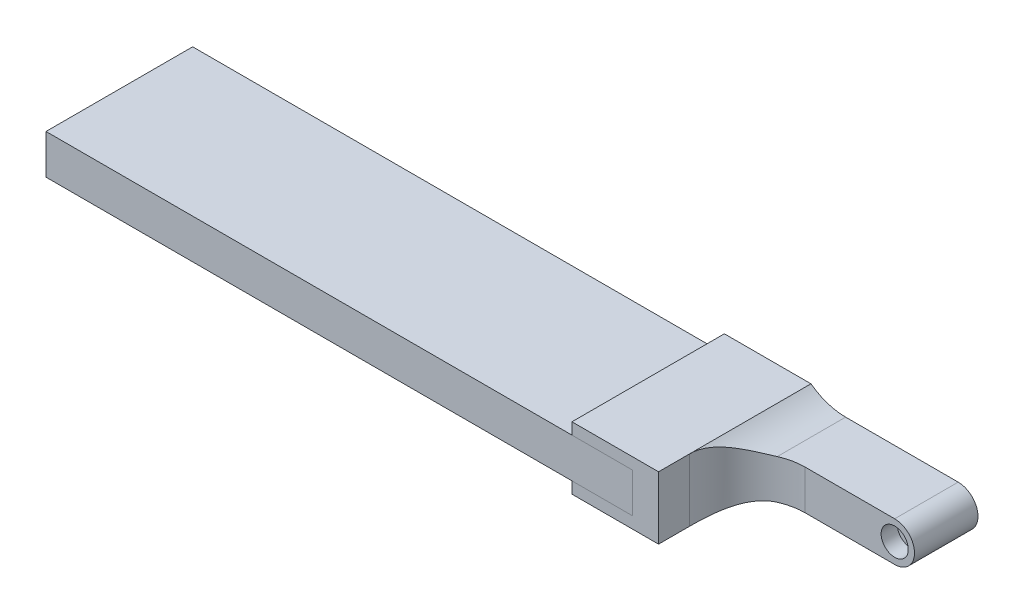
ISO-10303-21;
HEADER;
FILE_DESCRIPTION(('STEP AP214'),'2;1');
FILE_NAME('part.step','',(''),(''),'','','');
FILE_SCHEMA(('AUTOMOTIVE_DESIGN { 1 0 10303 214 1 1 1 1 }'));
ENDSEC;
DATA;
#1=APPLICATION_CONTEXT('core data for automotive mechanical design processes');
#2=APPLICATION_PROTOCOL_DEFINITION('international standard','automotive_design',2000,#1);
#3=PRODUCT_CONTEXT('',#1,'mechanical');
#4=PRODUCT('Part','Part','',(#3));
#5=PRODUCT_RELATED_PRODUCT_CATEGORY('part','',(#4));
#6=PRODUCT_DEFINITION_FORMATION('','',#4);
#7=PRODUCT_DEFINITION_CONTEXT('part definition',#1,'design');
#8=PRODUCT_DEFINITION('design','',#6,#7);
#9=PRODUCT_DEFINITION_SHAPE('','',#8);
#10=(LENGTH_UNIT() NAMED_UNIT(*) SI_UNIT(.MILLI.,.METRE.));
#11=(NAMED_UNIT(*) PLANE_ANGLE_UNIT() SI_UNIT($,.RADIAN.));
#12=(NAMED_UNIT(*) SI_UNIT($,.STERADIAN.) SOLID_ANGLE_UNIT());
#13=UNCERTAINTY_MEASURE_WITH_UNIT(LENGTH_MEASURE(1.E-05),#10,'distance_accuracy_value','');
#14=(GEOMETRIC_REPRESENTATION_CONTEXT(3) GLOBAL_UNCERTAINTY_ASSIGNED_CONTEXT((#13)) GLOBAL_UNIT_ASSIGNED_CONTEXT((#10,
#11,#12)) REPRESENTATION_CONTEXT('',''));
#15=CARTESIAN_POINT('',(0.,0.,0.));
#16=DIRECTION('',(0.,0.,1.));
#17=DIRECTION('',(1.,0.,0.));
#18=AXIS2_PLACEMENT_3D('',#15,#16,#17);
#19=CARTESIAN_POINT('',(-131.6,-3.42999999999993,0.));
#20=DIRECTION('',(0.,0.,1.));
#21=DIRECTION('',(1.,0.,0.));
#22=AXIS2_PLACEMENT_3D('',#19,#20,#21);
#23=PLANE('',#22);
#24=DIRECTION('',(0.,-1.,0.));
#25=VECTOR('',#24,1.);
#26=CARTESIAN_POINT('',(-30.,-3.42999999999998,0.));
#27=LINE('',#26,#25);
#28=CARTESIAN_POINT('',(-30.,3.43,0.));
#29=VERTEX_POINT('',#28);
#30=CARTESIAN_POINT('',(-30.,-3.42999999999998,0.));
#31=VERTEX_POINT('',#30);
#32=EDGE_CURVE('E116',#29,#31,#27,.T.);
#33=ORIENTED_EDGE('',*,*,#32,.T.);
#34=DIRECTION('',(1.,0.,0.));
#35=VECTOR('',#34,1.);
#36=CARTESIAN_POINT('',(-131.6,-3.42999999999993,0.));
#37=LINE('',#36,#35);
#38=CARTESIAN_POINT('',(-131.6,-3.42999999999993,0.));
#39=VERTEX_POINT('',#38);
#40=EDGE_CURVE('E12',#39,#31,#37,.T.);
#41=ORIENTED_EDGE('',*,*,#40,.F.);
#42=DIRECTION('',(0.,-1.,0.));
#43=VECTOR('',#42,1.);
#44=CARTESIAN_POINT('',(-131.6,-3.42999999999993,0.));
#45=LINE('',#44,#43);
#46=CARTESIAN_POINT('',(-131.6,3.43000000000005,0.));
#47=VERTEX_POINT('',#46);
#48=EDGE_CURVE('E104',#47,#39,#45,.T.);
#49=ORIENTED_EDGE('',*,*,#48,.F.);
#50=DIRECTION('',(1.,0.,0.));
#51=VECTOR('',#50,1.);
#52=CARTESIAN_POINT('',(-131.6,3.43000000000005,0.));
#53=LINE('',#52,#51);
#54=EDGE_CURVE('E112',#47,#29,#53,.T.);
#55=ORIENTED_EDGE('',*,*,#54,.T.);
#56=EDGE_LOOP('',(#33,#41,#49,#55));
#57=FACE_BOUND('',#56,.T.);
#58=ADVANCED_FACE('F53',(#57),#23,.F.);
#59=CARTESIAN_POINT('',(-131.6,-3.42999999999993,0.));
#60=DIRECTION('',(0.,1.,0.));
#61=DIRECTION('',(-1.,0.,0.));
#62=AXIS2_PLACEMENT_3D('',#59,#60,#61);
#63=PLANE('',#62);
#64=DIRECTION('',(0.,0.,1.));
#65=VECTOR('',#64,1.);
#66=CARTESIAN_POINT('',(-30.,-3.42999999999998,0.));
#67=LINE('',#66,#65);
#68=CARTESIAN_POINT('',(-30.,-3.42999999999998,25.4));
#69=VERTEX_POINT('',#68);
#70=EDGE_CURVE('E108',#31,#69,#67,.T.);
#71=ORIENTED_EDGE('',*,*,#70,.T.);
#72=DIRECTION('',(1.,0.,0.));
#73=VECTOR('',#72,1.);
#74=CARTESIAN_POINT('',(-131.6,-3.42999999999993,25.4));
#75=LINE('',#74,#73);
#76=CARTESIAN_POINT('',(-131.6,-3.42999999999993,25.4));
#77=VERTEX_POINT('',#76);
#78=EDGE_CURVE('E61',#77,#69,#75,.T.);
#79=ORIENTED_EDGE('',*,*,#78,.F.);
#80=DIRECTION('',(0.,0.,1.));
#81=VECTOR('',#80,1.);
#82=CARTESIAN_POINT('',(-131.6,-3.42999999999993,0.));
#83=LINE('',#82,#81);
#84=EDGE_CURVE('E99',#39,#77,#83,.T.);
#85=ORIENTED_EDGE('',*,*,#84,.F.);
#86=ORIENTED_EDGE('',*,*,#40,.T.);
#87=EDGE_LOOP('',(#71,#79,#85,#86));
#88=FACE_BOUND('',#87,.T.);
#89=ADVANCED_FACE('F107',(#88),#63,.F.);
#90=CARTESIAN_POINT('',(-131.6,-3.42999999999993,25.4));
#91=DIRECTION('',(0.,0.,-1.));
#92=DIRECTION('',(-1.,0.,0.));
#93=AXIS2_PLACEMENT_3D('',#90,#91,#92);
#94=PLANE('',#93);
#95=DIRECTION('',(0.,1.,0.));
#96=VECTOR('',#95,1.);
#97=CARTESIAN_POINT('',(-30.,-3.42999999999998,25.4));
#98=LINE('',#97,#96);
#99=CARTESIAN_POINT('',(-30.,3.43,25.4));
#100=VERTEX_POINT('',#99);
#101=EDGE_CURVE('E86',#69,#100,#98,.T.);
#102=ORIENTED_EDGE('',*,*,#101,.T.);
#103=DIRECTION('',(1.,0.,0.));
#104=VECTOR('',#103,1.);
#105=CARTESIAN_POINT('',(-131.6,3.43000000000005,25.4));
#106=LINE('',#105,#104);
#107=CARTESIAN_POINT('',(-131.6,3.43000000000005,25.4));
#108=VERTEX_POINT('',#107);
#109=EDGE_CURVE('E109',#108,#100,#106,.T.);
#110=ORIENTED_EDGE('',*,*,#109,.F.);
#111=DIRECTION('',(0.,1.,0.));
#112=VECTOR('',#111,1.);
#113=CARTESIAN_POINT('',(-131.6,-3.42999999999993,25.4));
#114=LINE('',#113,#112);
#115=EDGE_CURVE('E102',#77,#108,#114,.T.);
#116=ORIENTED_EDGE('',*,*,#115,.F.);
#117=ORIENTED_EDGE('',*,*,#78,.T.);
#118=EDGE_LOOP('',(#102,#110,#116,#117));
#119=FACE_BOUND('',#118,.T.);
#120=ADVANCED_FACE('F110',(#119),#94,.F.);
#121=CARTESIAN_POINT('',(-131.6,3.43000000000005,0.));
#122=DIRECTION('',(0.,-1.,0.));
#123=DIRECTION('',(1.,0.,0.));
#124=AXIS2_PLACEMENT_3D('',#121,#122,#123);
#125=PLANE('',#124);
#126=DIRECTION('',(0.,0.,-1.));
#127=VECTOR('',#126,1.);
#128=CARTESIAN_POINT('',(-30.,3.43,0.));
#129=LINE('',#128,#127);
#130=EDGE_CURVE('E92',#100,#29,#129,.T.);
#131=ORIENTED_EDGE('',*,*,#130,.T.);
#132=ORIENTED_EDGE('',*,*,#54,.F.);
#133=DIRECTION('',(0.,0.,-1.));
#134=VECTOR('',#133,1.);
#135=CARTESIAN_POINT('',(-131.6,3.43000000000005,0.));
#136=LINE('',#135,#134);
#137=EDGE_CURVE('E69',#108,#47,#136,.T.);
#138=ORIENTED_EDGE('',*,*,#137,.F.);
#139=ORIENTED_EDGE('',*,*,#109,.T.);
#140=EDGE_LOOP('',(#131,#132,#138,#139));
#141=FACE_BOUND('',#140,.T.);
#142=ADVANCED_FACE('F123',(#141),#125,.F.);
#143=CARTESIAN_POINT('',(-131.6,0.,0.));
#144=DIRECTION('',(1.,0.,0.));
#145=DIRECTION('',(0.,1.,0.));
#146=AXIS2_PLACEMENT_3D('',#143,#144,#145);
#147=PLANE('',#146);
#148=ORIENTED_EDGE('',*,*,#48,.T.);
#149=ORIENTED_EDGE('',*,*,#84,.T.);
#150=ORIENTED_EDGE('',*,*,#115,.T.);
#151=ORIENTED_EDGE('',*,*,#137,.T.);
#152=EDGE_LOOP('',(#148,#149,#150,#151));
#153=FACE_BOUND('',#152,.T.);
#154=ADVANCED_FACE('F100',(#153),#147,.F.);
#155=CARTESIAN_POINT('',(-30.,0.,0.));
#156=DIRECTION('',(1.,0.,0.));
#157=DIRECTION('',(0.,1.,0.));
#158=AXIS2_PLACEMENT_3D('',#155,#156,#157);
#159=PLANE('',#158);
#160=ORIENTED_EDGE('',*,*,#32,.F.);
#161=ORIENTED_EDGE('',*,*,#130,.F.);
#162=ORIENTED_EDGE('',*,*,#101,.F.);
#163=ORIENTED_EDGE('',*,*,#70,.F.);
#164=EDGE_LOOP('',(#160,#161,#162,#163));
#165=FACE_BOUND('',#164,.T.);
#166=ADVANCED_FACE('F126',(#165),#159,.T.);
#167=CLOSED_SHELL('',(#58,#89,#120,#142,#154,#166));
#168=MANIFOLD_SOLID_BREP('B2',#167);
#169=CARTESIAN_POINT('',(0.,3.43,10.));
#170=DIRECTION('',(0.,-1.,0.));
#171=DIRECTION('',(0.,0.,-1.));
#172=AXIS2_PLACEMENT_3D('',#169,#170,#171);
#173=PLANE('',#172);
#174=DIRECTION('',(0.,0.,-1.));
#175=VECTOR('',#174,1.);
#176=CARTESIAN_POINT('',(0.,3.43,10.));
#177=LINE('',#176,#175);
#178=CARTESIAN_POINT('',(0.,3.43,10.));
#179=VERTEX_POINT('',#178);
#180=CARTESIAN_POINT('',(0.,3.43,-1.));
#181=VERTEX_POINT('',#180);
#182=EDGE_CURVE('E294',#179,#181,#177,.T.);
#183=ORIENTED_EDGE('',*,*,#182,.T.);
#184=DIRECTION('',(1.,0.,0.));
#185=VECTOR('',#184,1.);
#186=CARTESIAN_POINT('',(-19.5,3.43,-1.));
#187=LINE('',#186,#185);
#188=CARTESIAN_POINT('',(-19.5,3.43,-1.));
#189=VERTEX_POINT('',#188);
#190=EDGE_CURVE('E309',#189,#181,#187,.T.);
#191=ORIENTED_EDGE('',*,*,#190,.F.);
#192=DIRECTION('',(0.,0.,-1.));
#193=VECTOR('',#192,1.);
#194=CARTESIAN_POINT('',(-19.5,3.43,10.));
#195=LINE('',#194,#193);
#196=CARTESIAN_POINT('',(-19.5,3.43,10.8348486100883));
#197=VERTEX_POINT('',#196);
#198=EDGE_CURVE('E204',#189,#197,#195,.F.);
#199=ORIENTED_EDGE('',*,*,#198,.T.);
#200=CARTESIAN_POINT('',(-15.5,3.43,20.));
#201=DIRECTION('',(0.,-1.,0.));
#202=DIRECTION('',(0.,0.,-1.));
#203=AXIS2_PLACEMENT_3D('',#200,#201,#202);
#204=CIRCLE('',#203,10.);
#205=CARTESIAN_POINT('',(-15.5,3.43,10.));
#206=VERTEX_POINT('',#205);
#207=EDGE_CURVE('E395',#197,#206,#204,.T.);
#208=ORIENTED_EDGE('',*,*,#207,.T.);
#209=DIRECTION('',(-1.,0.,0.));
#210=VECTOR('',#209,1.);
#211=CARTESIAN_POINT('',(0.,3.43,10.));
#212=LINE('',#211,#210);
#213=EDGE_CURVE('E372',#179,#206,#212,.T.);
#214=ORIENTED_EDGE('',*,*,#213,.F.);
#215=EDGE_LOOP('',(#183,#191,#199,#208,#214));
#216=FACE_BOUND('',#215,.T.);
#217=ADVANCED_FACE('F177',(#216),#173,.F.);
#218=CARTESIAN_POINT('',(0.,0.,10.));
#219=DIRECTION('',(0.,0.,-1.));
#220=DIRECTION('',(-1.,0.,0.));
#221=AXIS2_PLACEMENT_3D('',#218,#219,#220);
#222=CYLINDRICAL_SURFACE('',#221,3.43);
#223=CARTESIAN_POINT('',(0.,0.,10.));
#224=DIRECTION('',(0.,0.,1.));
#225=DIRECTION('',(1.,0.,0.));
#226=AXIS2_PLACEMENT_3D('',#223,#224,#225);
#227=CIRCLE('',#226,3.43);
#228=CARTESIAN_POINT('',(0.,-3.43,10.));
#229=VERTEX_POINT('',#228);
#230=EDGE_CURVE('E289',#229,#179,#227,.T.);
#231=ORIENTED_EDGE('',*,*,#230,.F.);
#232=DIRECTION('',(0.,0.,-1.));
#233=VECTOR('',#232,1.);
#234=CARTESIAN_POINT('',(0.,-3.43,10.));
#235=LINE('',#234,#233);
#236=CARTESIAN_POINT('',(0.,-3.43,-1.));
#237=VERTEX_POINT('',#236);
#238=EDGE_CURVE('E283',#229,#237,#235,.T.);
#239=ORIENTED_EDGE('',*,*,#238,.T.);
#240=CARTESIAN_POINT('',(0.,0.,-1.));
#241=DIRECTION('',(0.,0.,-1.));
#242=DIRECTION('',(-1.,0.,0.));
#243=AXIS2_PLACEMENT_3D('',#240,#241,#242);
#244=CIRCLE('',#243,3.43);
#245=EDGE_CURVE('E287',#181,#237,#244,.T.);
#246=ORIENTED_EDGE('',*,*,#245,.F.);
#247=ORIENTED_EDGE('',*,*,#182,.F.);
#248=EDGE_LOOP('',(#231,#239,#246,#247));
#249=FACE_BOUND('',#248,.T.);
#250=ADVANCED_FACE('F285',(#249),#222,.T.);
#251=CARTESIAN_POINT('',(0.,0.,10.));
#252=DIRECTION('',(0.,0.,1.));
#253=DIRECTION('',(1.,0.,0.));
#254=AXIS2_PLACEMENT_3D('',#251,#252,#253);
#255=PLANE('',#254);
#256=ORIENTED_EDGE('',*,*,#213,.T.);
#257=DIRECTION('',(0.,1.,0.));
#258=VECTOR('',#257,1.);
#259=CARTESIAN_POINT('',(-15.5,0.,10.));
#260=LINE('',#259,#258);
#261=CARTESIAN_POINT('',(-15.5,-3.42999999999999,10.));
#262=VERTEX_POINT('',#261);
#263=EDGE_CURVE('E393',#206,#262,#260,.F.);
#264=ORIENTED_EDGE('',*,*,#263,.T.);
#265=DIRECTION('',(-1.,0.,0.));
#266=VECTOR('',#265,1.);
#267=CARTESIAN_POINT('',(0.,-3.43,10.));
#268=LINE('',#267,#266);
#269=EDGE_CURVE('E375',#229,#262,#268,.T.);
#270=ORIENTED_EDGE('',*,*,#269,.F.);
#271=ORIENTED_EDGE('',*,*,#230,.T.);
#272=EDGE_LOOP('',(#256,#264,#270,#271));
#273=FACE_BOUND('',#272,.T.);
#274=CARTESIAN_POINT('',(0.,0.,10.));
#275=DIRECTION('',(0.,0.,1.));
#276=DIRECTION('',(1.,0.,0.));
#277=AXIS2_PLACEMENT_3D('',#274,#275,#276);
#278=CIRCLE('',#277,2.35);
#279=CARTESIAN_POINT('',(2.35,0.,10.));
#280=VERTEX_POINT('',#279);
#281=EDGE_CURVE('E380',#280,#280,#278,.T.);
#282=ORIENTED_EDGE('',*,*,#281,.F.);
#283=EDGE_LOOP('',(#282));
#284=FACE_BOUND('',#283,.T.);
#285=ADVANCED_FACE('F428',(#273,#284),#255,.T.);
#286=CARTESIAN_POINT('',(0.,0.,7.2));
#287=DIRECTION('',(0.,0.,1.));
#288=DIRECTION('',(1.,0.,0.));
#289=AXIS2_PLACEMENT_3D('',#286,#287,#288);
#290=CYLINDRICAL_SURFACE('',#289,2.35);
#291=CARTESIAN_POINT('',(0.,0.,7.2));
#292=DIRECTION('',(0.,0.,1.));
#293=DIRECTION('',(1.,0.,0.));
#294=AXIS2_PLACEMENT_3D('',#291,#292,#293);
#295=CIRCLE('',#294,2.35);
#296=CARTESIAN_POINT('',(2.35,0.,7.2));
#297=VERTEX_POINT('',#296);
#298=EDGE_CURVE('E385',#297,#297,#295,.T.);
#299=ORIENTED_EDGE('',*,*,#298,.F.);
#300=EDGE_LOOP('',(#299));
#301=FACE_BOUND('',#300,.T.);
#302=ORIENTED_EDGE('',*,*,#281,.T.);
#303=EDGE_LOOP('',(#302));
#304=FACE_BOUND('',#303,.T.);
#305=ADVANCED_FACE('F439',(#301,#304),#290,.F.);
#306=CARTESIAN_POINT('',(0.,0.,7.2));
#307=DIRECTION('',(0.,0.,1.));
#308=DIRECTION('',(1.,0.,0.));
#309=AXIS2_PLACEMENT_3D('',#306,#307,#308);
#310=PLANE('',#309);
#311=ORIENTED_EDGE('',*,*,#298,.T.);
#312=EDGE_LOOP('',(#311));
#313=FACE_BOUND('',#312,.T.);
#314=ADVANCED_FACE('F435',(#313),#310,.T.);
#315=CARTESIAN_POINT('',(-30.,0.,10.));
#316=DIRECTION('',(1.,0.,0.));
#317=DIRECTION('',(0.,1.,0.));
#318=AXIS2_PLACEMENT_3D('',#315,#316,#317);
#319=PLANE('',#318);
#320=DIRECTION('',(0.,-1.,0.));
#321=VECTOR('',#320,1.);
#322=CARTESIAN_POINT('',(-30.,0.,0.));
#323=LINE('',#322,#321);
#324=CARTESIAN_POINT('',(-30.,3.43,0.));
#325=VERTEX_POINT('',#324);
#326=CARTESIAN_POINT('',(-30.,-3.42999999999998,0.));
#327=VERTEX_POINT('',#326);
#328=EDGE_CURVE('E371',#325,#327,#323,.T.);
#329=ORIENTED_EDGE('',*,*,#328,.T.);
#330=DIRECTION('',(0.,0.,-1.));
#331=VECTOR('',#330,1.);
#332=CARTESIAN_POINT('',(-30.,-3.42999999999998,10.));
#333=LINE('',#332,#331);
#334=CARTESIAN_POINT('',(-30.,-3.42999999999998,25.4));
#335=VERTEX_POINT('',#334);
#336=EDGE_CURVE('E293',#335,#327,#333,.T.);
#337=ORIENTED_EDGE('',*,*,#336,.F.);
#338=DIRECTION('',(0.,-1.,0.));
#339=VECTOR('',#338,1.);
#340=CARTESIAN_POINT('',(-30.,-3.42999999999998,25.4));
#341=LINE('',#340,#339);
#342=CARTESIAN_POINT('',(-30.,3.43,25.4));
#343=VERTEX_POINT('',#342);
#344=EDGE_CURVE('E366',#343,#335,#341,.T.);
#345=ORIENTED_EDGE('',*,*,#344,.F.);
#346=DIRECTION('',(0.,0.,-1.));
#347=VECTOR('',#346,1.);
#348=CARTESIAN_POINT('',(-30.,3.43,10.));
#349=LINE('',#348,#347);
#350=EDGE_CURVE('E377',#343,#325,#349,.T.);
#351=ORIENTED_EDGE('',*,*,#350,.T.);
#352=EDGE_LOOP('',(#329,#337,#345,#351));
#353=FACE_BOUND('',#352,.T.);
#354=ADVANCED_FACE('F432',(#353),#319,.F.);
#355=CARTESIAN_POINT('',(0.,-3.43,10.));
#356=DIRECTION('',(0.,-1.,0.));
#357=DIRECTION('',(1.,0.,0.));
#358=AXIS2_PLACEMENT_3D('',#355,#356,#357);
#359=PLANE('',#358);
#360=CARTESIAN_POINT('',(-15.5,-3.42999999999999,20.));
#361=DIRECTION('',(0.,-1.,0.));
#362=DIRECTION('',(1.,0.,0.));
#363=AXIS2_PLACEMENT_3D('',#360,#361,#362);
#364=CIRCLE('',#363,10.);
#365=CARTESIAN_POINT('',(-19.5,-3.42999999999999,10.8348486100883));
#366=VERTEX_POINT('',#365);
#367=EDGE_CURVE('E397',#262,#366,#364,.F.);
#368=ORIENTED_EDGE('',*,*,#367,.T.);
#369=DIRECTION('',(0.,0.,-1.));
#370=VECTOR('',#369,1.);
#371=CARTESIAN_POINT('',(-19.5,-3.42999999999999,0.));
#372=LINE('',#371,#370);
#373=CARTESIAN_POINT('',(-19.5,-3.42999999999999,-1.));
#374=VERTEX_POINT('',#373);
#375=EDGE_CURVE('E300',#366,#374,#372,.T.);
#376=ORIENTED_EDGE('',*,*,#375,.T.);
#377=DIRECTION('',(-1.,0.,0.));
#378=VECTOR('',#377,1.);
#379=CARTESIAN_POINT('',(0.,-3.43,-1.));
#380=LINE('',#379,#378);
#381=EDGE_CURVE('E297',#237,#374,#380,.T.);
#382=ORIENTED_EDGE('',*,*,#381,.F.);
#383=ORIENTED_EDGE('',*,*,#238,.F.);
#384=ORIENTED_EDGE('',*,*,#269,.T.);
#385=EDGE_LOOP('',(#368,#376,#382,#383,#384));
#386=FACE_BOUND('',#385,.T.);
#387=ADVANCED_FACE('F298',(#386),#359,.T.);
#388=CARTESIAN_POINT('',(-25.5,-3.42999999999998,25.4));
#389=DIRECTION('',(-1.,0.,0.));
#390=DIRECTION('',(0.,0.,1.));
#391=AXIS2_PLACEMENT_3D('',#388,#389,#390);
#392=PLANE('',#391);
#393=DIRECTION('',(0.,1.,0.));
#394=VECTOR('',#393,1.);
#395=CARTESIAN_POINT('',(-25.5,-3.42999999999998,20.));
#396=LINE('',#395,#394);
#397=CARTESIAN_POINT('',(-25.5,-5.42999999999998,20.));
#398=VERTEX_POINT('',#397);
#399=CARTESIAN_POINT('',(-25.5,5.43,20.));
#400=VERTEX_POINT('',#399);
#401=EDGE_CURVE('E391',#398,#400,#396,.T.);
#402=ORIENTED_EDGE('',*,*,#401,.T.);
#403=DIRECTION('',(0.,0.,-1.));
#404=VECTOR('',#403,1.);
#405=CARTESIAN_POINT('',(-25.5,5.43,25.4));
#406=LINE('',#405,#404);
#407=CARTESIAN_POINT('',(-25.5,5.43,25.4));
#408=VERTEX_POINT('',#407);
#409=EDGE_CURVE('E348',#408,#400,#406,.T.);
#410=ORIENTED_EDGE('',*,*,#409,.F.);
#411=DIRECTION('',(0.,1.,0.));
#412=VECTOR('',#411,1.);
#413=CARTESIAN_POINT('',(-25.5,-3.42999999999998,25.4));
#414=LINE('',#413,#412);
#415=CARTESIAN_POINT('',(-25.5,-5.42999999999998,25.4));
#416=VERTEX_POINT('',#415);
#417=EDGE_CURVE('E369',#416,#408,#414,.T.);
#418=ORIENTED_EDGE('',*,*,#417,.F.);
#419=DIRECTION('',(0.,0.,-1.));
#420=VECTOR('',#419,1.);
#421=CARTESIAN_POINT('',(-25.5,-5.42999999999998,25.4));
#422=LINE('',#421,#420);
#423=EDGE_CURVE('E329',#416,#398,#422,.T.);
#424=ORIENTED_EDGE('',*,*,#423,.T.);
#425=EDGE_LOOP('',(#402,#410,#418,#424));
#426=FACE_BOUND('',#425,.T.);
#427=ADVANCED_FACE('F471',(#426),#392,.F.);
#428=CARTESIAN_POINT('',(0.,0.,25.4));
#429=DIRECTION('',(0.,0.,-1.));
#430=DIRECTION('',(-1.,0.,0.));
#431=AXIS2_PLACEMENT_3D('',#428,#429,#430);
#432=PLANE('',#431);
#433=ORIENTED_EDGE('',*,*,#344,.T.);
#434=DIRECTION('',(1.,0.,0.));
#435=VECTOR('',#434,1.);
#436=CARTESIAN_POINT('',(-25.5,-3.42999999999998,25.4));
#437=LINE('',#436,#435);
#438=CARTESIAN_POINT('',(-40.5,-3.42999999999998,25.4));
#439=VERTEX_POINT('',#438);
#440=EDGE_CURVE('E327',#439,#335,#437,.T.);
#441=ORIENTED_EDGE('',*,*,#440,.F.);
#442=DIRECTION('',(0.,1.,0.));
#443=VECTOR('',#442,1.);
#444=CARTESIAN_POINT('',(-40.5,-5.42999999999997,25.4));
#445=LINE('',#444,#443);
#446=CARTESIAN_POINT('',(-40.5,-5.42999999999997,25.4));
#447=VERTEX_POINT('',#446);
#448=EDGE_CURVE('E339',#447,#439,#445,.T.);
#449=ORIENTED_EDGE('',*,*,#448,.F.);
#450=DIRECTION('',(1.,0.,0.));
#451=VECTOR('',#450,1.);
#452=CARTESIAN_POINT('',(-25.5,-5.42999999999998,25.4));
#453=LINE('',#452,#451);
#454=EDGE_CURVE('E332',#447,#416,#453,.T.);
#455=ORIENTED_EDGE('',*,*,#454,.T.);
#456=ORIENTED_EDGE('',*,*,#417,.T.);
#457=DIRECTION('',(1.,0.,0.));
#458=VECTOR('',#457,1.);
#459=CARTESIAN_POINT('',(-25.5,5.43,25.4));
#460=LINE('',#459,#458);
#461=CARTESIAN_POINT('',(-40.5,5.43,25.4));
#462=VERTEX_POINT('',#461);
#463=EDGE_CURVE('E354',#462,#408,#460,.T.);
#464=ORIENTED_EDGE('',*,*,#463,.F.);
#465=DIRECTION('',(0.,-1.,0.));
#466=VECTOR('',#465,1.);
#467=CARTESIAN_POINT('',(-40.5,5.43,25.4));
#468=LINE('',#467,#466);
#469=CARTESIAN_POINT('',(-40.5,3.43,25.4));
#470=VERTEX_POINT('',#469);
#471=EDGE_CURVE('E357',#462,#470,#468,.T.);
#472=ORIENTED_EDGE('',*,*,#471,.T.);
#473=DIRECTION('',(1.,0.,0.));
#474=VECTOR('',#473,1.);
#475=CARTESIAN_POINT('',(-25.5,3.43,25.4));
#476=LINE('',#475,#474);
#477=EDGE_CURVE('E362',#470,#343,#476,.T.);
#478=ORIENTED_EDGE('',*,*,#477,.T.);
#479=EDGE_LOOP('',(#433,#441,#449,#455,#456,#464,#472,#478));
#480=FACE_BOUND('',#479,.T.);
#481=ADVANCED_FACE('F473',(#480),#432,.F.);
#482=CARTESIAN_POINT('',(-15.5,-3.42999999999998,20.));
#483=DIRECTION('',(0.,1.,0.));
#484=DIRECTION('',(0.,0.,1.));
#485=AXIS2_PLACEMENT_3D('',#482,#483,#484);
#486=CYLINDRICAL_SURFACE('',#485,10.);
#487=ORIENTED_EDGE('',*,*,#367,.F.);
#488=ORIENTED_EDGE('',*,*,#263,.F.);
#489=ORIENTED_EDGE('',*,*,#207,.F.);
#490=CARTESIAN_POINT('',(-19.5,3.43,10.8348486100883));
#491=CARTESIAN_POINT('',(-19.6187109610031,3.42999837212061,10.8866561290224));
#492=CARTESIAN_POINT('',(-19.7363889836066,3.43211421942015,10.9407635059395));
#493=CARTESIAN_POINT('',(-19.9694243170225,3.44034397106759,11.0534370178745));
#494=CARTESIAN_POINT('',(-20.0847820291021,3.4464571778896,11.112002373415));
#495=CARTESIAN_POINT('',(-20.4266852270623,3.47041293678749,11.2940059682856));
#496=CARTESIAN_POINT('',(-20.6494461428949,3.49387317096378,11.4239201349009));
#497=CARTESIAN_POINT('',(-21.0810890071107,3.55339908248872,11.6984135701289));
#498=CARTESIAN_POINT('',(-21.2900755967413,3.58935233273701,11.8428541387368));
#499=CARTESIAN_POINT('',(-21.6952191181028,3.67173376738858,12.1461274486718));
#500=CARTESIAN_POINT('',(-21.8913717192728,3.71816546425045,12.3049650052761));
#501=CARTESIAN_POINT('',(-22.2689111737217,3.81901171815238,12.6349235724211));
#502=CARTESIAN_POINT('',(-22.4503719824313,3.87338185391026,12.8059736867876));
#503=CARTESIAN_POINT('',(-22.7990598738679,3.98807605812059,13.1600072251384));
#504=CARTESIAN_POINT('',(-22.9662881821942,4.0483996129399,13.3429896192001));
#505=CARTESIAN_POINT('',(-23.4472234908114,4.23555505306645,13.9100325216959));
#506=CARTESIAN_POINT('',(-23.73904519219,4.36824419143136,14.3111912646023));
#507=CARTESIAN_POINT('',(-24.1478131208893,4.57418335256193,14.9706305466454));
#508=CARTESIAN_POINT('',(-24.2858995400851,4.64838737679132,15.2159136270562));
#509=CARTESIAN_POINT('',(-24.5414182127357,4.79254761445333,15.7183960125155));
#510=CARTESIAN_POINT('',(-24.6588465170332,4.8625030140176,15.9755975841432));
#511=CARTESIAN_POINT('',(-24.8716865514968,4.99432453719016,16.4998197027327));
#512=CARTESIAN_POINT('',(-24.9671760604903,5.05621889027129,16.7668015454309));
#513=CARTESIAN_POINT('',(-25.1356123157912,5.16863487496453,17.3100678339152));
#514=CARTESIAN_POINT('',(-25.2085703994759,5.21916222274678,17.5863475233372));
#515=CARTESIAN_POINT('',(-25.3075953191934,5.28911737288216,18.0397388392999));
#516=CARTESIAN_POINT('',(-25.3409424899082,5.31306413138,18.2145982995132));
#517=CARTESIAN_POINT('',(-25.3983327587577,5.3546717695703,18.5665490065889));
#518=CARTESIAN_POINT('',(-25.4223784212995,5.37233438168127,18.7436396244031));
#519=CARTESIAN_POINT('',(-25.4610501627541,5.40089697506265,19.1001442162141));
#520=CARTESIAN_POINT('',(-25.4756365458399,5.41176845043991,19.2795647990223));
#521=CARTESIAN_POINT('',(-25.4951217241856,5.4263419510398,19.6393180845468));
#522=CARTESIAN_POINT('',(-25.5000151879644,5.43004003059368,19.819651234573));
#523=CARTESIAN_POINT('',(-25.5,5.43,20.));
#524=B_SPLINE_CURVE_WITH_KNOTS('',3,(#490,#491,#492,#493,#494,#495,#496,#497,#498,#499,#500,
#501,#502,#503,#504,#505,#506,#507,#508,#509,#510,#511,#512,#513,#514,#515,#516,#517,#518,#519,
#520,#521,#522,#523),.UNSPECIFIED.,.F.,.F.,(4,2,2,2,2,2,2,2,2,2,2,2,2,2,2,2,4),(0.,
0.388479442585753,0.77689111488955,1.55245826320373,2.32121934007227,3.09023849554652,
3.85510858334244,4.61991273931814,6.15411710124245,7.02663873389677,7.89932698338389,
8.76887186381761,9.63797849050516,10.1765014044168,10.7148757426563,11.2554949919626,
11.7964115203166),.UNSPECIFIED.);
#525=EDGE_CURVE('E191',#197,#400,#524,.T.);
#526=ORIENTED_EDGE('',*,*,#525,.T.);
#527=ORIENTED_EDGE('',*,*,#401,.F.);
#528=CARTESIAN_POINT('',(-25.5,-5.42999999999998,20.));
#529=CARTESIAN_POINT('',(-25.5000017185279,-5.43000727064081,19.8705078019825));
#530=CARTESIAN_POINT('',(-25.4974841361309,-5.42811242665482,19.7410366557674));
#531=CARTESIAN_POINT('',(-25.4874343158094,-5.4205875101876,19.4824104033922));
#532=CARTESIAN_POINT('',(-25.4799025760992,-5.41495780880759,19.3532552671124));
#533=CARTESIAN_POINT('',(-25.4498518691412,-5.39259209100616,18.9670292246558));
#534=CARTESIAN_POINT('',(-25.4198772515411,-5.37037904629476,18.7108010943432));
#535=CARTESIAN_POINT('',(-25.340926177625,-5.31298646133182,18.2052643459503));
#536=CARTESIAN_POINT('',(-25.2921251768277,-5.2779267943594,17.9559139720309));
#537=CARTESIAN_POINT('',(-25.1762155923526,-5.19680055007461,17.4632883131055));
#538=CARTESIAN_POINT('',(-25.1091017499632,-5.15073081158501,17.2200147950649));
#539=CARTESIAN_POINT('',(-24.9577101442283,-5.05016732443746,16.7420479968007));
#540=CARTESIAN_POINT('',(-24.8735184253046,-4.99571612381725,16.5073183998347));
#541=CARTESIAN_POINT('',(-24.6885252055983,-4.88066723090059,16.0461699174762));
#542=CARTESIAN_POINT('',(-24.5877245640328,-4.82006985662194,15.8197506029145));
#543=CARTESIAN_POINT('',(-24.2604373097866,-4.63218753376791,15.1522429308597));
#544=CARTESIAN_POINT('',(-24.0095275578826,-4.49914380807644,14.724351600942));
#545=CARTESIAN_POINT('',(-23.5686938663888,-4.29343003284353,14.0860086416206));
#546=CARTESIAN_POINT('',(-23.3992075068257,-4.2194928825914,13.8614364983551));
#547=CARTESIAN_POINT('',(-23.0410560690294,-4.07595816223974,13.4264330475396));
#548=CARTESIAN_POINT('',(-22.8523875871359,-4.0063613658362,13.2160042606172));
#549=CARTESIAN_POINT('',(-22.4572908892903,-3.8750201939718,12.8114117734756));
#550=CARTESIAN_POINT('',(-22.2509277895735,-3.81324893840748,12.6171932228206));
#551=CARTESIAN_POINT('',(-21.8207568593062,-3.70048488769441,12.2457310847799));
#552=CARTESIAN_POINT('',(-21.5969568926783,-3.64948727177418,12.0684799246675));
#553=CARTESIAN_POINT('',(-21.2211804180264,-3.57814632647348,11.7963603999534));
#554=CARTESIAN_POINT('',(-21.0741446748089,-3.55351159926268,11.6957374635946));
#555=CARTESIAN_POINT('',(-20.7742980112029,-3.51036821847339,11.5021409055842));
#556=CARTESIAN_POINT('',(-20.6214890216462,-3.49185753659807,11.4091647589811));
#557=CARTESIAN_POINT('',(-20.3099739112437,-3.46162465746269,11.2309376515154));
#558=CARTESIAN_POINT('',(-20.1512472128096,-3.44992907402127,11.1457180589939));
#559=CARTESIAN_POINT('',(-19.8290162038564,-3.43410827738094,10.9837791753611));
#560=CARTESIAN_POINT('',(-19.6655086642838,-3.42998830673867,10.9070658052902));
#561=CARTESIAN_POINT('',(-19.5,-3.42999999999999,10.8348486100883));
#562=B_SPLINE_CURVE_WITH_KNOTS('',3,(#528,#529,#530,#531,#532,#533,#534,#535,#536,#537,#538,
#539,#540,#541,#542,#543,#544,#545,#546,#547,#548,#549,#550,#551,#552,#553,#554,#555,#556,#557,
#558,#559,#560,#561),.UNSPECIFIED.,.F.,.F.,(4,2,2,2,2,2,2,2,2,2,2,2,2,2,2,2,4),(0.,
0.388397216646647,0.776755847322487,1.55228834891335,2.32076125963707,3.08945507753379,
3.85436807132897,4.61924150685919,6.15360805950025,7.02554532816276,7.89763758358617,
8.76664800086788,9.6352687433667,10.1745490292412,10.7136505251135,11.2548434105815,
11.79641067739),.UNSPECIFIED.);
#563=EDGE_CURVE('E51',#398,#366,#562,.T.);
#564=ORIENTED_EDGE('',*,*,#563,.T.);
#565=EDGE_LOOP('',(#487,#488,#489,#526,#527,#564));
#566=FACE_BOUND('',#565,.T.);
#567=ADVANCED_FACE('F405',(#566),#486,.F.);
#568=CARTESIAN_POINT('',(0.,3.43,0.));
#569=DIRECTION('',(0.,1.,0.));
#570=DIRECTION('',(0.,0.,1.));
#571=AXIS2_PLACEMENT_3D('',#568,#569,#570);
#572=PLANE('',#571);
#573=DIRECTION('',(-1.,0.,0.));
#574=VECTOR('',#573,1.);
#575=CARTESIAN_POINT('',(-25.5,3.43,0.));
#576=LINE('',#575,#574);
#577=CARTESIAN_POINT('',(-40.5,3.43,0.));
#578=VERTEX_POINT('',#577);
#579=EDGE_CURVE('E347',#325,#578,#576,.T.);
#580=ORIENTED_EDGE('',*,*,#579,.F.);
#581=ORIENTED_EDGE('',*,*,#350,.F.);
#582=ORIENTED_EDGE('',*,*,#477,.F.);
#583=DIRECTION('',(0.,0.,1.));
#584=VECTOR('',#583,1.);
#585=CARTESIAN_POINT('',(-40.5,3.43,25.4));
#586=LINE('',#585,#584);
#587=EDGE_CURVE('E360',#578,#470,#586,.T.);
#588=ORIENTED_EDGE('',*,*,#587,.F.);
#589=EDGE_LOOP('',(#580,#581,#582,#588));
#590=FACE_BOUND('',#589,.T.);
#591=ADVANCED_FACE('F485',(#590),#572,.F.);
#592=CARTESIAN_POINT('',(-40.5,5.43,25.4));
#593=DIRECTION('',(1.,0.,0.));
#594=DIRECTION('',(0.,0.,-1.));
#595=AXIS2_PLACEMENT_3D('',#592,#593,#594);
#596=PLANE('',#595);
#597=ORIENTED_EDGE('',*,*,#587,.T.);
#598=ORIENTED_EDGE('',*,*,#471,.F.);
#599=DIRECTION('',(0.,0.,1.));
#600=VECTOR('',#599,1.);
#601=CARTESIAN_POINT('',(-40.5,5.43,25.4));
#602=LINE('',#601,#600);
#603=CARTESIAN_POINT('',(-40.5,5.43,-1.));
#604=VERTEX_POINT('',#603);
#605=EDGE_CURVE('E351',#604,#462,#602,.T.);
#606=ORIENTED_EDGE('',*,*,#605,.F.);
#607=DIRECTION('',(0.,1.,0.));
#608=VECTOR('',#607,1.);
#609=CARTESIAN_POINT('',(-40.5,-5.42999999999997,-1.));
#610=LINE('',#609,#608);
#611=CARTESIAN_POINT('',(-40.5,-5.42999999999997,-1.));
#612=VERTEX_POINT('',#611);
#613=EDGE_CURVE('E319',#612,#604,#610,.T.);
#614=ORIENTED_EDGE('',*,*,#613,.F.);
#615=DIRECTION('',(0.,0.,1.));
#616=VECTOR('',#615,1.);
#617=CARTESIAN_POINT('',(-40.5,-5.42999999999997,25.4));
#618=LINE('',#617,#616);
#619=EDGE_CURVE('E336',#612,#447,#618,.T.);
#620=ORIENTED_EDGE('',*,*,#619,.T.);
#621=ORIENTED_EDGE('',*,*,#448,.T.);
#622=DIRECTION('',(0.,0.,1.));
#623=VECTOR('',#622,1.);
#624=CARTESIAN_POINT('',(-40.5,-3.42999999999998,25.4));
#625=LINE('',#624,#623);
#626=CARTESIAN_POINT('',(-40.5,-3.42999999999998,0.));
#627=VERTEX_POINT('',#626);
#628=EDGE_CURVE('E341',#627,#439,#625,.T.);
#629=ORIENTED_EDGE('',*,*,#628,.F.);
#630=DIRECTION('',(0.,1.,0.));
#631=VECTOR('',#630,1.);
#632=CARTESIAN_POINT('',(-40.5,3.43,0.));
#633=LINE('',#632,#631);
#634=EDGE_CURVE('E310',#627,#578,#633,.T.);
#635=ORIENTED_EDGE('',*,*,#634,.T.);
#636=EDGE_LOOP('',(#597,#598,#606,#614,#620,#621,#629,#635));
#637=FACE_BOUND('',#636,.T.);
#638=ADVANCED_FACE('F460',(#637),#596,.F.);
#639=CARTESIAN_POINT('',(0.,5.43,0.));
#640=DIRECTION('',(0.,1.,0.));
#641=DIRECTION('',(0.,0.,1.));
#642=AXIS2_PLACEMENT_3D('',#639,#640,#641);
#643=PLANE('',#642);
#644=ORIENTED_EDGE('',*,*,#409,.T.);
#645=CARTESIAN_POINT('',(-25.5,5.43,-1.));
#646=VERTEX_POINT('',#645);
#647=EDGE_CURVE('E352',#400,#646,#406,.T.);
#648=ORIENTED_EDGE('',*,*,#647,.T.);
#649=DIRECTION('',(1.,0.,0.));
#650=VECTOR('',#649,1.);
#651=CARTESIAN_POINT('',(-40.5,5.43,-1.));
#652=LINE('',#651,#650);
#653=EDGE_CURVE('E322',#604,#646,#652,.T.);
#654=ORIENTED_EDGE('',*,*,#653,.F.);
#655=ORIENTED_EDGE('',*,*,#605,.T.);
#656=ORIENTED_EDGE('',*,*,#463,.T.);
#657=EDGE_LOOP('',(#644,#648,#654,#655,#656));
#658=FACE_BOUND('',#657,.T.);
#659=ADVANCED_FACE('F467',(#658),#643,.T.);
#660=CARTESIAN_POINT('',(0.,-3.43,0.));
#661=DIRECTION('',(0.,-1.,0.));
#662=DIRECTION('',(0.,0.,1.));
#663=AXIS2_PLACEMENT_3D('',#660,#661,#662);
#664=PLANE('',#663);
#665=ORIENTED_EDGE('',*,*,#440,.T.);
#666=ORIENTED_EDGE('',*,*,#336,.T.);
#667=DIRECTION('',(-1.,0.,0.));
#668=VECTOR('',#667,1.);
#669=CARTESIAN_POINT('',(-25.5,-3.42999999999998,0.));
#670=LINE('',#669,#668);
#671=EDGE_CURVE('E344',#327,#627,#670,.T.);
#672=ORIENTED_EDGE('',*,*,#671,.T.);
#673=ORIENTED_EDGE('',*,*,#628,.T.);
#674=EDGE_LOOP('',(#665,#666,#672,#673));
#675=FACE_BOUND('',#674,.T.);
#676=ADVANCED_FACE('F418',(#675),#664,.F.);
#677=CARTESIAN_POINT('',(0.,-5.43,0.));
#678=DIRECTION('',(0.,-1.,0.));
#679=DIRECTION('',(0.,0.,1.));
#680=AXIS2_PLACEMENT_3D('',#677,#678,#679);
#681=PLANE('',#680);
#682=ORIENTED_EDGE('',*,*,#423,.F.);
#683=ORIENTED_EDGE('',*,*,#454,.F.);
#684=ORIENTED_EDGE('',*,*,#619,.F.);
#685=DIRECTION('',(-1.,0.,0.));
#686=VECTOR('',#685,1.);
#687=CARTESIAN_POINT('',(-25.5,-5.42999999999999,-1.));
#688=LINE('',#687,#686);
#689=CARTESIAN_POINT('',(-25.5,-5.42999999999999,-1.));
#690=VERTEX_POINT('',#689);
#691=EDGE_CURVE('E316',#690,#612,#688,.T.);
#692=ORIENTED_EDGE('',*,*,#691,.F.);
#693=EDGE_CURVE('E333',#398,#690,#422,.T.);
#694=ORIENTED_EDGE('',*,*,#693,.F.);
#695=EDGE_LOOP('',(#682,#683,#684,#692,#694));
#696=FACE_BOUND('',#695,.T.);
#697=ADVANCED_FACE('F411',(#696),#681,.T.);
#698=CARTESIAN_POINT('',(-19.5,13.43,25.4));
#699=DIRECTION('',(0.,0.,-1.));
#700=DIRECTION('',(-1.,0.,0.));
#701=AXIS2_PLACEMENT_3D('',#698,#699,#700);
#702=CYLINDRICAL_SURFACE('',#701,10.);
#703=ORIENTED_EDGE('',*,*,#525,.F.);
#704=ORIENTED_EDGE('',*,*,#198,.F.);
#705=CARTESIAN_POINT('',(-19.5,13.43,-1.));
#706=DIRECTION('',(0.,0.,1.));
#707=DIRECTION('',(-1.,0.,0.));
#708=AXIS2_PLACEMENT_3D('',#705,#706,#707);
#709=CIRCLE('',#708,10.);
#710=EDGE_CURVE('E325',#646,#189,#709,.T.);
#711=ORIENTED_EDGE('',*,*,#710,.F.);
#712=ORIENTED_EDGE('',*,*,#647,.F.);
#713=EDGE_LOOP('',(#703,#704,#711,#712));
#714=FACE_BOUND('',#713,.T.);
#715=ADVANCED_FACE('F408',(#714),#702,.F.);
#716=CARTESIAN_POINT('',(-19.5,-13.43,25.4));
#717=DIRECTION('',(0.,0.,1.));
#718=DIRECTION('',(1.,0.,0.));
#719=AXIS2_PLACEMENT_3D('',#716,#717,#718);
#720=CYLINDRICAL_SURFACE('',#719,10.);
#721=ORIENTED_EDGE('',*,*,#563,.F.);
#722=ORIENTED_EDGE('',*,*,#693,.T.);
#723=CARTESIAN_POINT('',(-19.5,-13.43,-1.));
#724=DIRECTION('',(0.,0.,1.));
#725=DIRECTION('',(-1.,0.,0.));
#726=AXIS2_PLACEMENT_3D('',#723,#724,#725);
#727=CIRCLE('',#726,10.);
#728=EDGE_CURVE('E304',#374,#690,#727,.T.);
#729=ORIENTED_EDGE('',*,*,#728,.F.);
#730=ORIENTED_EDGE('',*,*,#375,.F.);
#731=EDGE_LOOP('',(#721,#722,#729,#730));
#732=FACE_BOUND('',#731,.T.);
#733=ADVANCED_FACE('F179',(#732),#720,.F.);
#734=CARTESIAN_POINT('',(0.,0.,-1.));
#735=DIRECTION('',(0.,0.,-1.));
#736=DIRECTION('',(-1.,0.,0.));
#737=AXIS2_PLACEMENT_3D('',#734,#735,#736);
#738=PLANE('',#737);
#739=ORIENTED_EDGE('',*,*,#245,.T.);
#740=ORIENTED_EDGE('',*,*,#381,.T.);
#741=ORIENTED_EDGE('',*,*,#728,.T.);
#742=ORIENTED_EDGE('',*,*,#691,.T.);
#743=ORIENTED_EDGE('',*,*,#613,.T.);
#744=ORIENTED_EDGE('',*,*,#653,.T.);
#745=ORIENTED_EDGE('',*,*,#710,.T.);
#746=ORIENTED_EDGE('',*,*,#190,.T.);
#747=EDGE_LOOP('',(#739,#740,#741,#742,#743,#744,#745,#746));
#748=FACE_BOUND('',#747,.T.);
#749=ADVANCED_FACE('F307',(#748),#738,.T.);
#750=CARTESIAN_POINT('',(0.,0.,0.));
#751=DIRECTION('',(0.,0.,-1.));
#752=DIRECTION('',(-1.,0.,0.));
#753=AXIS2_PLACEMENT_3D('',#750,#751,#752);
#754=PLANE('',#753);
#755=ORIENTED_EDGE('',*,*,#671,.F.);
#756=ORIENTED_EDGE('',*,*,#328,.F.);
#757=ORIENTED_EDGE('',*,*,#579,.T.);
#758=ORIENTED_EDGE('',*,*,#634,.F.);
#759=EDGE_LOOP('',(#755,#756,#757,#758));
#760=FACE_BOUND('',#759,.T.);
#761=ADVANCED_FACE('F481',(#760),#754,.F.);
#762=CLOSED_SHELL('',(#217,#250,#285,#305,#314,#354,#387,#427,#481,#567,#591,#638,#659,#676,
#697,#715,#733,#749,#761));
#763=MANIFOLD_SOLID_BREP('B6',#762);
#764=ADVANCED_BREP_SHAPE_REPRESENTATION('',(#18,#168,#763),#14);
#765=SHAPE_DEFINITION_REPRESENTATION(#9,#764);
ENDSEC;
END-ISO-10303-21;
